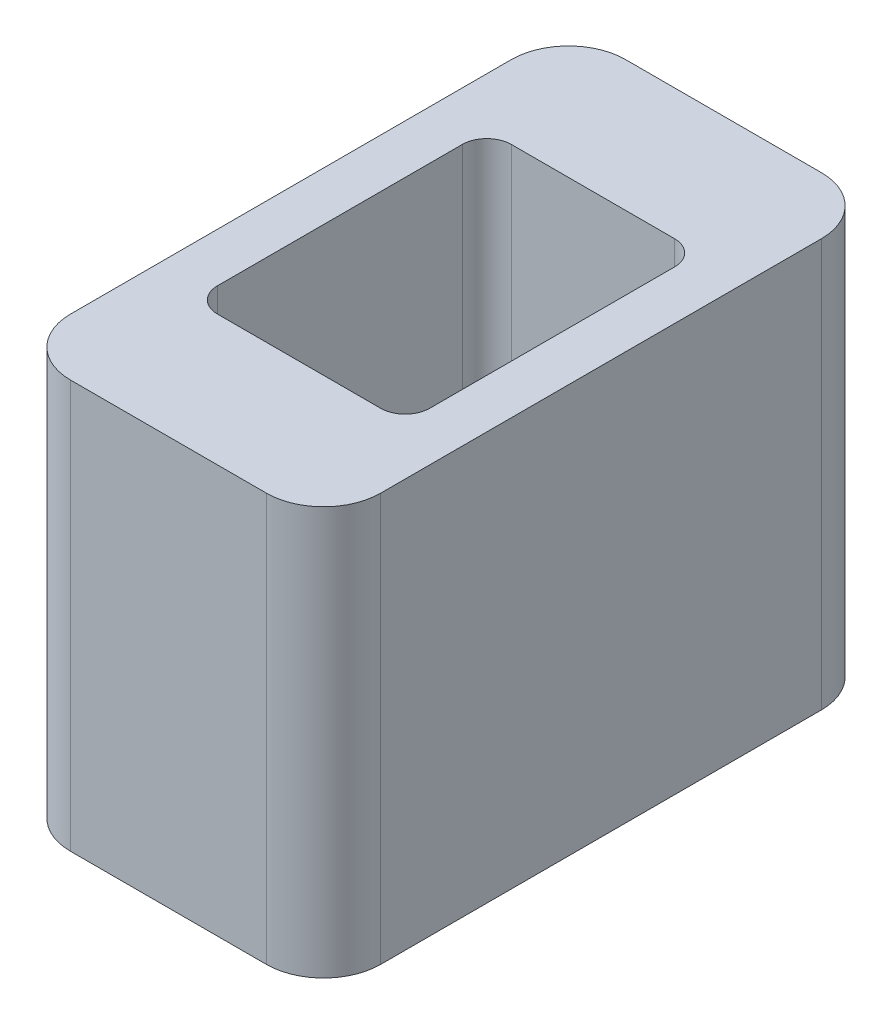
ISO-10303-21;
HEADER;
FILE_DESCRIPTION(('STEP AP214'),'2;1');
FILE_NAME('part.step','',(''),(''),'','','');
FILE_SCHEMA(('AUTOMOTIVE_DESIGN { 1 0 10303 214 1 1 1 1 }'));
ENDSEC;
DATA;
#1=APPLICATION_CONTEXT('core data for automotive mechanical design processes');
#2=APPLICATION_PROTOCOL_DEFINITION('international standard','automotive_design',2000,#1);
#3=PRODUCT_CONTEXT('',#1,'mechanical');
#4=PRODUCT('Part','Part','',(#3));
#5=PRODUCT_RELATED_PRODUCT_CATEGORY('part','',(#4));
#6=PRODUCT_DEFINITION_FORMATION('','',#4);
#7=PRODUCT_DEFINITION_CONTEXT('part definition',#1,'design');
#8=PRODUCT_DEFINITION('design','',#6,#7);
#9=PRODUCT_DEFINITION_SHAPE('','',#8);
#10=(LENGTH_UNIT() NAMED_UNIT(*) SI_UNIT(.MILLI.,.METRE.));
#11=(NAMED_UNIT(*) PLANE_ANGLE_UNIT() SI_UNIT($,.RADIAN.));
#12=(NAMED_UNIT(*) SI_UNIT($,.STERADIAN.) SOLID_ANGLE_UNIT());
#13=UNCERTAINTY_MEASURE_WITH_UNIT(LENGTH_MEASURE(1.E-05),#10,'distance_accuracy_value','');
#14=(GEOMETRIC_REPRESENTATION_CONTEXT(3) GLOBAL_UNCERTAINTY_ASSIGNED_CONTEXT((#13)) GLOBAL_UNIT_ASSIGNED_CONTEXT((#10,
#11,#12)) REPRESENTATION_CONTEXT('',''));
#15=CARTESIAN_POINT('',(0.,0.,0.));
#16=DIRECTION('',(0.,0.,1.));
#17=DIRECTION('',(1.,0.,0.));
#18=AXIS2_PLACEMENT_3D('',#15,#16,#17);
#19=CARTESIAN_POINT('',(-50.2610968965143,8.00000000000036,-55.2200768086937));
#20=DIRECTION('',(0.,-1.,0.));
#21=DIRECTION('',(-1.,0.,0.));
#22=AXIS2_PLACEMENT_3D('',#19,#20,#21);
#23=PLANE('',#22);
#24=DIRECTION('',(-1.,0.,0.));
#25=VECTOR('',#24,1.);
#26=CARTESIAN_POINT('',(8.65,8.,2.79999999999879));
#27=LINE('',#26,#25);
#28=CARTESIAN_POINT('',(8.65,8.,2.79999999999879));
#29=VERTEX_POINT('',#28);
#30=CARTESIAN_POINT('',(6.65000000000012,8.,2.79999999999879));
#31=VERTEX_POINT('',#30);
#32=EDGE_CURVE('E203',#29,#31,#27,.T.);
#33=ORIENTED_EDGE('',*,*,#32,.F.);
#34=CARTESIAN_POINT('',(8.65,8.,3.09999999999888));
#35=DIRECTION('',(0.,-1.,0.));
#36=DIRECTION('',(1.,0.,0.));
#37=AXIS2_PLACEMENT_3D('',#34,#35,#36);
#38=CIRCLE('',#37,0.300000000000047);
#39=CARTESIAN_POINT('',(8.95,7.9999999999999,3.09999999999888));
#40=VERTEX_POINT('',#39);
#41=EDGE_CURVE('E229',#29,#40,#38,.T.);
#42=ORIENTED_EDGE('',*,*,#41,.T.);
#43=DIRECTION('',(0.,0.,1.));
#44=VECTOR('',#43,1.);
#45=CARTESIAN_POINT('',(8.95,7.9999999999999,3.09999999999888));
#46=LINE('',#45,#44);
#47=CARTESIAN_POINT('',(8.95,7.9999999999999,6.09999999999889));
#48=VERTEX_POINT('',#47);
#49=EDGE_CURVE('E323',#40,#48,#46,.T.);
#50=ORIENTED_EDGE('',*,*,#49,.T.);
#51=CARTESIAN_POINT('',(8.65,8.,6.09999999999889));
#52=DIRECTION('',(0.,-1.,0.));
#53=DIRECTION('',(1.,0.,0.));
#54=AXIS2_PLACEMENT_3D('',#51,#52,#53);
#55=CIRCLE('',#54,0.29999999999994);
#56=CARTESIAN_POINT('',(8.65,8.,6.39999999999878));
#57=VERTEX_POINT('',#56);
#58=EDGE_CURVE('E246',#48,#57,#55,.T.);
#59=ORIENTED_EDGE('',*,*,#58,.T.);
#60=DIRECTION('',(1.,0.,0.));
#61=VECTOR('',#60,1.);
#62=CARTESIAN_POINT('',(6.65000000000012,8.,6.3999999999989));
#63=LINE('',#62,#61);
#64=CARTESIAN_POINT('',(6.65000000000012,8.,6.3999999999989));
#65=VERTEX_POINT('',#64);
#66=EDGE_CURVE('E63',#65,#57,#63,.T.);
#67=ORIENTED_EDGE('',*,*,#66,.F.);
#68=CARTESIAN_POINT('',(6.65000000000012,8.,6.09999999999889));
#69=DIRECTION('',(0.,-1.,0.));
#70=DIRECTION('',(1.,0.,0.));
#71=AXIS2_PLACEMENT_3D('',#68,#69,#70);
#72=CIRCLE('',#71,0.29999999999999);
#73=CARTESIAN_POINT('',(6.35000000000011,8.,6.09999999999889));
#74=VERTEX_POINT('',#73);
#75=EDGE_CURVE('E256',#65,#74,#72,.T.);
#76=ORIENTED_EDGE('',*,*,#75,.T.);
#77=DIRECTION('',(0.,0.,1.));
#78=VECTOR('',#77,1.);
#79=CARTESIAN_POINT('',(6.35000000000011,8.,3.09999999999888));
#80=LINE('',#79,#78);
#81=CARTESIAN_POINT('',(6.35000000000011,8.,3.09999999999888));
#82=VERTEX_POINT('',#81);
#83=EDGE_CURVE('E266',#82,#74,#80,.T.);
#84=ORIENTED_EDGE('',*,*,#83,.F.);
#85=CARTESIAN_POINT('',(6.65000000000012,8.,3.09999999999888));
#86=DIRECTION('',(0.,-1.,0.));
#87=DIRECTION('',(1.,0.,0.));
#88=AXIS2_PLACEMENT_3D('',#85,#86,#87);
#89=CIRCLE('',#88,0.300000000000011);
#90=EDGE_CURVE('E285',#82,#31,#89,.T.);
#91=ORIENTED_EDGE('',*,*,#90,.T.);
#92=EDGE_LOOP('',(#33,#42,#50,#59,#67,#76,#84,#91));
#93=FACE_BOUND('',#92,.T.);
#94=CARTESIAN_POINT('',(8.84999999999982,8.00000000000019,1.8999999999989));
#95=DIRECTION('',(0.,-1.,0.));
#96=DIRECTION('',(1.,0.,0.));
#97=AXIS2_PLACEMENT_3D('',#94,#95,#96);
#98=CIRCLE('',#97,0.7);
#99=CARTESIAN_POINT('',(8.84999999999982,8.00000000000019,1.19999999999879));
#100=VERTEX_POINT('',#99);
#101=CARTESIAN_POINT('',(9.55000000000015,7.99999999999989,1.8999999999989));
#102=VERTEX_POINT('',#101);
#103=EDGE_CURVE('E199',#100,#102,#98,.T.);
#104=ORIENTED_EDGE('',*,*,#103,.F.);
#105=DIRECTION('',(1.,0.,0.));
#106=VECTOR('',#105,1.);
#107=CARTESIAN_POINT('',(6.44999999999965,8.00000000000043,1.19999999999879));
#108=LINE('',#107,#106);
#109=CARTESIAN_POINT('',(6.44999999999965,8.00000000000043,1.19999999999879));
#110=VERTEX_POINT('',#109);
#111=EDGE_CURVE('E26',#110,#100,#108,.T.);
#112=ORIENTED_EDGE('',*,*,#111,.F.);
#113=CARTESIAN_POINT('',(6.44999999999965,8.00000000000043,1.8999999999989));
#114=DIRECTION('',(0.,-1.,0.));
#115=DIRECTION('',(1.,0.,0.));
#116=AXIS2_PLACEMENT_3D('',#113,#114,#115);
#117=CIRCLE('',#116,0.699999999999989);
#118=CARTESIAN_POINT('',(5.75,8.,1.8999999999989));
#119=VERTEX_POINT('',#118);
#120=EDGE_CURVE('E186',#119,#110,#117,.T.);
#121=ORIENTED_EDGE('',*,*,#120,.F.);
#122=DIRECTION('',(0.,0.,-1.));
#123=VECTOR('',#122,1.);
#124=CARTESIAN_POINT('',(5.75,8.,7.29999999999889));
#125=LINE('',#124,#123);
#126=CARTESIAN_POINT('',(5.75,8.,7.29999999999889));
#127=VERTEX_POINT('',#126);
#128=EDGE_CURVE('E190',#127,#119,#125,.T.);
#129=ORIENTED_EDGE('',*,*,#128,.F.);
#130=CARTESIAN_POINT('',(6.44999999999965,8.00000000000043,7.29999999999889));
#131=DIRECTION('',(0.,-1.,0.));
#132=DIRECTION('',(1.,0.,0.));
#133=AXIS2_PLACEMENT_3D('',#130,#131,#132);
#134=CIRCLE('',#133,0.699999999999989);
#135=CARTESIAN_POINT('',(6.44999999999965,8.00000000000043,7.99999999999889));
#136=VERTEX_POINT('',#135);
#137=EDGE_CURVE('E277',#136,#127,#134,.T.);
#138=ORIENTED_EDGE('',*,*,#137,.F.);
#139=DIRECTION('',(1.,0.,0.));
#140=VECTOR('',#139,1.);
#141=CARTESIAN_POINT('',(6.44999999999965,8.00000000000043,7.99999999999889));
#142=LINE('',#141,#140);
#143=CARTESIAN_POINT('',(8.84999999999982,8.00000000000019,7.99999999999889));
#144=VERTEX_POINT('',#143);
#145=EDGE_CURVE('E243',#136,#144,#142,.T.);
#146=ORIENTED_EDGE('',*,*,#145,.T.);
#147=CARTESIAN_POINT('',(8.84999999999982,8.00000000000019,7.29999999999889));
#148=DIRECTION('',(0.,-1.,0.));
#149=DIRECTION('',(1.,0.,0.));
#150=AXIS2_PLACEMENT_3D('',#147,#148,#149);
#151=CIRCLE('',#150,0.699999999999989);
#152=CARTESIAN_POINT('',(9.55000000000015,7.99999999999989,7.29999999999889));
#153=VERTEX_POINT('',#152);
#154=EDGE_CURVE('E134',#153,#144,#151,.T.);
#155=ORIENTED_EDGE('',*,*,#154,.F.);
#156=DIRECTION('',(0.,0.,-1.));
#157=VECTOR('',#156,1.);
#158=CARTESIAN_POINT('',(9.55000000000015,7.99999999999989,7.29999999999889));
#159=LINE('',#158,#157);
#160=EDGE_CURVE('E343',#153,#102,#159,.T.);
#161=ORIENTED_EDGE('',*,*,#160,.T.);
#162=EDGE_LOOP('',(#104,#112,#121,#129,#138,#146,#155,#161));
#163=FACE_BOUND('',#162,.T.);
#164=ADVANCED_FACE('F15',(#93,#163),#23,.F.);
#165=CARTESIAN_POINT('',(-50.2610968965141,3.00000000000021,-55.2200768086937));
#166=DIRECTION('',(0.,-1.,0.));
#167=DIRECTION('',(-1.,0.,0.));
#168=AXIS2_PLACEMENT_3D('',#165,#166,#167);
#169=PLANE('',#168);
#170=CARTESIAN_POINT('',(6.65000000000032,2.99999999999976,3.09999999999888));
#171=DIRECTION('',(0.,-1.,0.));
#172=DIRECTION('',(1.,0.,0.));
#173=AXIS2_PLACEMENT_3D('',#170,#171,#172);
#174=CIRCLE('',#173,0.300000000000011);
#175=CARTESIAN_POINT('',(6.35000000000025,2.99999999999977,3.09999999999888));
#176=VERTEX_POINT('',#175);
#177=CARTESIAN_POINT('',(6.65000000000032,2.99999999999976,2.79999999999879));
#178=VERTEX_POINT('',#177);
#179=EDGE_CURVE('E263',#176,#178,#174,.T.);
#180=ORIENTED_EDGE('',*,*,#179,.F.);
#181=DIRECTION('',(0.,0.,1.));
#182=VECTOR('',#181,1.);
#183=CARTESIAN_POINT('',(6.35000000000025,2.99999999999977,3.09999999999888));
#184=LINE('',#183,#182);
#185=CARTESIAN_POINT('',(6.35000000000025,2.99999999999977,6.09999999999889));
#186=VERTEX_POINT('',#185);
#187=EDGE_CURVE('E237',#176,#186,#184,.T.);
#188=ORIENTED_EDGE('',*,*,#187,.T.);
#189=CARTESIAN_POINT('',(6.65000000000032,2.99999999999976,6.09999999999889));
#190=DIRECTION('',(0.,-1.,0.));
#191=DIRECTION('',(1.,0.,0.));
#192=AXIS2_PLACEMENT_3D('',#189,#190,#191);
#193=CIRCLE('',#192,0.29999999999999);
#194=CARTESIAN_POINT('',(6.65000000000032,2.99999999999976,6.3999999999989));
#195=VERTEX_POINT('',#194);
#196=EDGE_CURVE('E79',#195,#186,#193,.T.);
#197=ORIENTED_EDGE('',*,*,#196,.F.);
#198=DIRECTION('',(1.,0.,0.));
#199=VECTOR('',#198,1.);
#200=CARTESIAN_POINT('',(6.65000000000032,2.99999999999976,6.3999999999989));
#201=LINE('',#200,#199);
#202=CARTESIAN_POINT('',(8.65000000000023,2.99999999999981,6.3999999999989));
#203=VERTEX_POINT('',#202);
#204=EDGE_CURVE('E259',#195,#203,#201,.T.);
#205=ORIENTED_EDGE('',*,*,#204,.T.);
#206=CARTESIAN_POINT('',(8.65000000000023,2.99999999999981,6.09999999999889));
#207=DIRECTION('',(0.,-1.,0.));
#208=DIRECTION('',(1.,0.,0.));
#209=AXIS2_PLACEMENT_3D('',#206,#207,#208);
#210=CIRCLE('',#209,0.29999999999994);
#211=CARTESIAN_POINT('',(8.95000000000022,2.99999999999975,6.09999999999889));
#212=VERTEX_POINT('',#211);
#213=EDGE_CURVE('E202',#212,#203,#210,.T.);
#214=ORIENTED_EDGE('',*,*,#213,.F.);
#215=DIRECTION('',(0.,0.,1.));
#216=VECTOR('',#215,1.);
#217=CARTESIAN_POINT('',(8.95000000000022,2.99999999999975,3.09999999999888));
#218=LINE('',#217,#216);
#219=CARTESIAN_POINT('',(8.95000000000022,2.99999999999975,3.09999999999888));
#220=VERTEX_POINT('',#219);
#221=EDGE_CURVE('E280',#220,#212,#218,.T.);
#222=ORIENTED_EDGE('',*,*,#221,.F.);
#223=CARTESIAN_POINT('',(8.65000000000023,2.99999999999981,3.09999999999888));
#224=DIRECTION('',(0.,-1.,0.));
#225=DIRECTION('',(1.,0.,0.));
#226=AXIS2_PLACEMENT_3D('',#223,#224,#225);
#227=CIRCLE('',#226,0.300000000000047);
#228=CARTESIAN_POINT('',(8.65000000000023,2.99999999999981,2.79999999999879));
#229=VERTEX_POINT('',#228);
#230=EDGE_CURVE('E207',#229,#220,#227,.T.);
#231=ORIENTED_EDGE('',*,*,#230,.F.);
#232=DIRECTION('',(-1.,0.,0.));
#233=VECTOR('',#232,1.);
#234=CARTESIAN_POINT('',(8.65000000000023,2.99999999999981,2.79999999999879));
#235=LINE('',#234,#233);
#236=EDGE_CURVE('E215',#229,#178,#235,.T.);
#237=ORIENTED_EDGE('',*,*,#236,.T.);
#238=EDGE_LOOP('',(#180,#188,#197,#205,#214,#222,#231,#237));
#239=FACE_BOUND('',#238,.T.);
#240=DIRECTION('',(0.,0.,-1.));
#241=VECTOR('',#240,1.);
#242=CARTESIAN_POINT('',(9.54999999999964,3.00000000000045,7.29999999999889));
#243=LINE('',#242,#241);
#244=CARTESIAN_POINT('',(9.54999999999964,3.00000000000045,7.29999999999889));
#245=VERTEX_POINT('',#244);
#246=CARTESIAN_POINT('',(9.54999999999964,3.00000000000045,1.8999999999989));
#247=VERTEX_POINT('',#246);
#248=EDGE_CURVE('E326',#245,#247,#243,.T.);
#249=ORIENTED_EDGE('',*,*,#248,.F.);
#250=CARTESIAN_POINT('',(8.85,3.,7.29999999999889));
#251=DIRECTION('',(0.,-1.,0.));
#252=DIRECTION('',(1.,0.,0.));
#253=AXIS2_PLACEMENT_3D('',#250,#251,#252);
#254=CIRCLE('',#253,0.699999999999989);
#255=CARTESIAN_POINT('',(8.85,3.,7.99999999999889));
#256=VERTEX_POINT('',#255);
#257=EDGE_CURVE('E145',#245,#256,#254,.T.);
#258=ORIENTED_EDGE('',*,*,#257,.T.);
#259=DIRECTION('',(1.,0.,0.));
#260=VECTOR('',#259,1.);
#261=CARTESIAN_POINT('',(6.44999999999985,3.00000000000025,7.99999999999889));
#262=LINE('',#261,#260);
#263=CARTESIAN_POINT('',(6.44999999999985,3.00000000000025,7.99999999999889));
#264=VERTEX_POINT('',#263);
#265=EDGE_CURVE('E242',#264,#256,#262,.T.);
#266=ORIENTED_EDGE('',*,*,#265,.F.);
#267=CARTESIAN_POINT('',(6.44999999999985,3.00000000000025,7.29999999999889));
#268=DIRECTION('',(0.,-1.,0.));
#269=DIRECTION('',(1.,0.,0.));
#270=AXIS2_PLACEMENT_3D('',#267,#268,#269);
#271=CIRCLE('',#270,0.699999999999989);
#272=CARTESIAN_POINT('',(5.75000000000023,2.99999999999985,7.29999999999889));
#273=VERTEX_POINT('',#272);
#274=EDGE_CURVE('E181',#264,#273,#271,.T.);
#275=ORIENTED_EDGE('',*,*,#274,.T.);
#276=DIRECTION('',(0.,0.,-1.));
#277=VECTOR('',#276,1.);
#278=CARTESIAN_POINT('',(5.75000000000023,2.99999999999985,7.29999999999889));
#279=LINE('',#278,#277);
#280=CARTESIAN_POINT('',(5.75000000000023,2.99999999999985,1.8999999999989));
#281=VERTEX_POINT('',#280);
#282=EDGE_CURVE('E178',#273,#281,#279,.T.);
#283=ORIENTED_EDGE('',*,*,#282,.T.);
#284=CARTESIAN_POINT('',(6.44999999999985,3.00000000000025,1.8999999999989));
#285=DIRECTION('',(0.,-1.,0.));
#286=DIRECTION('',(1.,0.,0.));
#287=AXIS2_PLACEMENT_3D('',#284,#285,#286);
#288=CIRCLE('',#287,0.699999999999989);
#289=CARTESIAN_POINT('',(6.44999999999985,3.00000000000025,1.19999999999879));
#290=VERTEX_POINT('',#289);
#291=EDGE_CURVE('E165',#281,#290,#288,.T.);
#292=ORIENTED_EDGE('',*,*,#291,.T.);
#293=DIRECTION('',(1.,0.,0.));
#294=VECTOR('',#293,1.);
#295=CARTESIAN_POINT('',(6.44999999999985,3.00000000000025,1.19999999999879));
#296=LINE('',#295,#294);
#297=CARTESIAN_POINT('',(8.85,3.,1.19999999999879));
#298=VERTEX_POINT('',#297);
#299=EDGE_CURVE('E10',#290,#298,#296,.T.);
#300=ORIENTED_EDGE('',*,*,#299,.T.);
#301=CARTESIAN_POINT('',(8.85,3.,1.8999999999989));
#302=DIRECTION('',(0.,-1.,0.));
#303=DIRECTION('',(1.,0.,0.));
#304=AXIS2_PLACEMENT_3D('',#301,#302,#303);
#305=CIRCLE('',#304,0.7);
#306=EDGE_CURVE('E250',#298,#247,#305,.T.);
#307=ORIENTED_EDGE('',*,*,#306,.T.);
#308=EDGE_LOOP('',(#249,#258,#266,#275,#283,#292,#300,#307));
#309=FACE_BOUND('',#308,.T.);
#310=ADVANCED_FACE('F179',(#239,#309),#169,.T.);
#311=CARTESIAN_POINT('',(8.84999999999982,8.00000000000019,1.19999999999879));
#312=DIRECTION('',(0.,0.,-1.));
#313=DIRECTION('',(0.707106781186542,-0.707106781186553,0.));
#314=AXIS2_PLACEMENT_3D('',#311,#312,#313);
#315=PLANE('',#314);
#316=ORIENTED_EDGE('',*,*,#111,.T.);
#317=DIRECTION('',(0.,-1.,0.));
#318=VECTOR('',#317,1.);
#319=CARTESIAN_POINT('',(8.84999999999982,8.00000000000019,1.19999999999879));
#320=LINE('',#319,#318);
#321=EDGE_CURVE('E271',#100,#298,#320,.T.);
#322=ORIENTED_EDGE('',*,*,#321,.T.);
#323=ORIENTED_EDGE('',*,*,#299,.F.);
#324=DIRECTION('',(0.,-1.,0.));
#325=VECTOR('',#324,1.);
#326=CARTESIAN_POINT('',(6.44999999999965,8.00000000000043,1.19999999999879));
#327=LINE('',#326,#325);
#328=EDGE_CURVE('E172',#110,#290,#327,.T.);
#329=ORIENTED_EDGE('',*,*,#328,.F.);
#330=EDGE_LOOP('',(#316,#322,#323,#329));
#331=FACE_BOUND('',#330,.T.);
#332=ADVANCED_FACE('F395',(#331),#315,.T.);
#333=CARTESIAN_POINT('',(6.44999999999965,8.00000000000043,1.8999999999989));
#334=DIRECTION('',(0.,-1.,0.));
#335=DIRECTION('',(1.,0.,0.));
#336=AXIS2_PLACEMENT_3D('',#333,#334,#335);
#337=CYLINDRICAL_SURFACE('',#336,0.699999999999989);
#338=ORIENTED_EDGE('',*,*,#120,.T.);
#339=ORIENTED_EDGE('',*,*,#328,.T.);
#340=ORIENTED_EDGE('',*,*,#291,.F.);
#341=DIRECTION('',(0.,-1.,0.));
#342=VECTOR('',#341,1.);
#343=CARTESIAN_POINT('',(5.75,8.,1.8999999999989));
#344=LINE('',#343,#342);
#345=EDGE_CURVE('E170',#119,#281,#344,.T.);
#346=ORIENTED_EDGE('',*,*,#345,.F.);
#347=EDGE_LOOP('',(#338,#339,#340,#346));
#348=FACE_BOUND('',#347,.T.);
#349=ADVANCED_FACE('F168',(#348),#337,.T.);
#350=CARTESIAN_POINT('',(5.75,8.,1.8999999999989));
#351=DIRECTION('',(-1.,0.,0.));
#352=DIRECTION('',(0.,0.,1.));
#353=AXIS2_PLACEMENT_3D('',#350,#351,#352);
#354=PLANE('',#353);
#355=ORIENTED_EDGE('',*,*,#128,.T.);
#356=ORIENTED_EDGE('',*,*,#345,.T.);
#357=ORIENTED_EDGE('',*,*,#282,.F.);
#358=DIRECTION('',(0.,-1.,0.));
#359=VECTOR('',#358,1.);
#360=CARTESIAN_POINT('',(5.75,8.,7.29999999999889));
#361=LINE('',#360,#359);
#362=EDGE_CURVE('E19',#127,#273,#361,.T.);
#363=ORIENTED_EDGE('',*,*,#362,.F.);
#364=EDGE_LOOP('',(#355,#356,#357,#363));
#365=FACE_BOUND('',#364,.T.);
#366=ADVANCED_FACE('F188',(#365),#354,.T.);
#367=CARTESIAN_POINT('',(6.44999999999965,8.00000000000043,7.29999999999889));
#368=DIRECTION('',(0.,-1.,0.));
#369=DIRECTION('',(1.,0.,0.));
#370=AXIS2_PLACEMENT_3D('',#367,#368,#369);
#371=CYLINDRICAL_SURFACE('',#370,0.699999999999989);
#372=ORIENTED_EDGE('',*,*,#137,.T.);
#373=ORIENTED_EDGE('',*,*,#362,.T.);
#374=ORIENTED_EDGE('',*,*,#274,.F.);
#375=DIRECTION('',(0.,-1.,0.));
#376=VECTOR('',#375,1.);
#377=CARTESIAN_POINT('',(6.44999999999965,8.00000000000043,7.99999999999889));
#378=LINE('',#377,#376);
#379=EDGE_CURVE('E238',#136,#264,#378,.T.);
#380=ORIENTED_EDGE('',*,*,#379,.F.);
#381=EDGE_LOOP('',(#372,#373,#374,#380));
#382=FACE_BOUND('',#381,.T.);
#383=ADVANCED_FACE('F402',(#382),#371,.T.);
#384=CARTESIAN_POINT('',(6.44999999999965,8.00000000000043,7.99999999999889));
#385=DIRECTION('',(0.,0.,1.));
#386=DIRECTION('',(0.707106781186553,0.707106781186542,0.));
#387=AXIS2_PLACEMENT_3D('',#384,#385,#386);
#388=PLANE('',#387);
#389=DIRECTION('',(0.,-1.,0.));
#390=VECTOR('',#389,1.);
#391=CARTESIAN_POINT('',(8.84999999999982,8.00000000000019,7.99999999999889));
#392=LINE('',#391,#390);
#393=EDGE_CURVE('E262',#144,#256,#392,.T.);
#394=ORIENTED_EDGE('',*,*,#393,.F.);
#395=ORIENTED_EDGE('',*,*,#145,.F.);
#396=ORIENTED_EDGE('',*,*,#379,.T.);
#397=ORIENTED_EDGE('',*,*,#265,.T.);
#398=EDGE_LOOP('',(#394,#395,#396,#397));
#399=FACE_BOUND('',#398,.T.);
#400=ADVANCED_FACE('F362',(#399),#388,.T.);
#401=CARTESIAN_POINT('',(8.84999999999982,8.00000000000019,7.29999999999889));
#402=DIRECTION('',(0.,-1.,0.));
#403=DIRECTION('',(1.,0.,0.));
#404=AXIS2_PLACEMENT_3D('',#401,#402,#403);
#405=CYLINDRICAL_SURFACE('',#404,0.699999999999989);
#406=ORIENTED_EDGE('',*,*,#154,.T.);
#407=ORIENTED_EDGE('',*,*,#393,.T.);
#408=ORIENTED_EDGE('',*,*,#257,.F.);
#409=DIRECTION('',(0.,-1.,0.));
#410=VECTOR('',#409,1.);
#411=CARTESIAN_POINT('',(9.55000000000015,7.99999999999989,7.29999999999889));
#412=LINE('',#411,#410);
#413=EDGE_CURVE('E233',#153,#245,#412,.T.);
#414=ORIENTED_EDGE('',*,*,#413,.F.);
#415=EDGE_LOOP('',(#406,#407,#408,#414));
#416=FACE_BOUND('',#415,.T.);
#417=ADVANCED_FACE('F363',(#416),#405,.T.);
#418=CARTESIAN_POINT('',(9.55000000000015,7.99999999999989,7.29999999999889));
#419=DIRECTION('',(1.,0.,0.));
#420=DIRECTION('',(0.,0.,-1.));
#421=AXIS2_PLACEMENT_3D('',#418,#419,#420);
#422=PLANE('',#421);
#423=ORIENTED_EDGE('',*,*,#160,.F.);
#424=ORIENTED_EDGE('',*,*,#413,.T.);
#425=ORIENTED_EDGE('',*,*,#248,.T.);
#426=DIRECTION('',(0.,-1.,0.));
#427=VECTOR('',#426,1.);
#428=CARTESIAN_POINT('',(9.55000000000015,7.99999999999989,1.8999999999989));
#429=LINE('',#428,#427);
#430=EDGE_CURVE('E201',#102,#247,#429,.T.);
#431=ORIENTED_EDGE('',*,*,#430,.F.);
#432=EDGE_LOOP('',(#423,#424,#425,#431));
#433=FACE_BOUND('',#432,.T.);
#434=ADVANCED_FACE('F368',(#433),#422,.T.);
#435=CARTESIAN_POINT('',(8.84999999999982,8.00000000000019,1.8999999999989));
#436=DIRECTION('',(0.,-1.,0.));
#437=DIRECTION('',(1.,0.,0.));
#438=AXIS2_PLACEMENT_3D('',#435,#436,#437);
#439=CYLINDRICAL_SURFACE('',#438,0.7);
#440=ORIENTED_EDGE('',*,*,#103,.T.);
#441=ORIENTED_EDGE('',*,*,#430,.T.);
#442=ORIENTED_EDGE('',*,*,#306,.F.);
#443=ORIENTED_EDGE('',*,*,#321,.F.);
#444=EDGE_LOOP('',(#440,#441,#442,#443));
#445=FACE_BOUND('',#444,.T.);
#446=ADVANCED_FACE('F397',(#445),#439,.T.);
#447=CARTESIAN_POINT('',(8.65,8.,6.09999999999889));
#448=DIRECTION('',(0.,-1.,0.));
#449=DIRECTION('',(1.,0.,0.));
#450=AXIS2_PLACEMENT_3D('',#447,#448,#449);
#451=CYLINDRICAL_SURFACE('',#450,0.29999999999994);
#452=DIRECTION('',(0.,-1.,0.));
#453=VECTOR('',#452,1.);
#454=CARTESIAN_POINT('',(8.65,8.,6.3999999999989));
#455=LINE('',#454,#453);
#456=EDGE_CURVE('E311',#57,#203,#455,.T.);
#457=ORIENTED_EDGE('',*,*,#456,.F.);
#458=ORIENTED_EDGE('',*,*,#58,.F.);
#459=DIRECTION('',(0.,-1.,0.));
#460=VECTOR('',#459,1.);
#461=CARTESIAN_POINT('',(8.95,7.9999999999999,6.09999999999889));
#462=LINE('',#461,#460);
#463=EDGE_CURVE('E253',#48,#212,#462,.T.);
#464=ORIENTED_EDGE('',*,*,#463,.T.);
#465=ORIENTED_EDGE('',*,*,#213,.T.);
#466=EDGE_LOOP('',(#457,#458,#464,#465));
#467=FACE_BOUND('',#466,.T.);
#468=ADVANCED_FACE('F298',(#467),#451,.F.);
#469=CARTESIAN_POINT('',(8.65,8.,6.3999999999989));
#470=DIRECTION('',(0.,0.,-1.));
#471=DIRECTION('',(0.707106781186542,-0.707106781186553,0.));
#472=AXIS2_PLACEMENT_3D('',#469,#470,#471);
#473=PLANE('',#472);
#474=ORIENTED_EDGE('',*,*,#456,.T.);
#475=ORIENTED_EDGE('',*,*,#204,.F.);
#476=DIRECTION('',(0.,-1.,0.));
#477=VECTOR('',#476,1.);
#478=CARTESIAN_POINT('',(6.65000000000012,8.,6.3999999999989));
#479=LINE('',#478,#477);
#480=EDGE_CURVE('E235',#65,#195,#479,.T.);
#481=ORIENTED_EDGE('',*,*,#480,.F.);
#482=ORIENTED_EDGE('',*,*,#66,.T.);
#483=EDGE_LOOP('',(#474,#475,#481,#482));
#484=FACE_BOUND('',#483,.T.);
#485=ADVANCED_FACE('F313',(#484),#473,.T.);
#486=CARTESIAN_POINT('',(6.65000000000012,8.,6.09999999999889));
#487=DIRECTION('',(0.,-1.,0.));
#488=DIRECTION('',(1.,0.,0.));
#489=AXIS2_PLACEMENT_3D('',#486,#487,#488);
#490=CYLINDRICAL_SURFACE('',#489,0.29999999999999);
#491=ORIENTED_EDGE('',*,*,#480,.T.);
#492=ORIENTED_EDGE('',*,*,#196,.T.);
#493=DIRECTION('',(0.,-1.,0.));
#494=VECTOR('',#493,1.);
#495=CARTESIAN_POINT('',(6.35000000000011,8.,6.09999999999889));
#496=LINE('',#495,#494);
#497=EDGE_CURVE('E337',#74,#186,#496,.T.);
#498=ORIENTED_EDGE('',*,*,#497,.F.);
#499=ORIENTED_EDGE('',*,*,#75,.F.);
#500=EDGE_LOOP('',(#491,#492,#498,#499));
#501=FACE_BOUND('',#500,.T.);
#502=ADVANCED_FACE('F442',(#501),#490,.F.);
#503=CARTESIAN_POINT('',(6.35000000000011,8.,6.09999999999889));
#504=DIRECTION('',(1.,0.,0.));
#505=DIRECTION('',(0.,0.,-1.));
#506=AXIS2_PLACEMENT_3D('',#503,#504,#505);
#507=PLANE('',#506);
#508=ORIENTED_EDGE('',*,*,#83,.T.);
#509=ORIENTED_EDGE('',*,*,#497,.T.);
#510=ORIENTED_EDGE('',*,*,#187,.F.);
#511=DIRECTION('',(0.,-1.,0.));
#512=VECTOR('',#511,1.);
#513=CARTESIAN_POINT('',(6.35000000000011,8.,3.09999999999888));
#514=LINE('',#513,#512);
#515=EDGE_CURVE('E267',#82,#176,#514,.T.);
#516=ORIENTED_EDGE('',*,*,#515,.F.);
#517=EDGE_LOOP('',(#508,#509,#510,#516));
#518=FACE_BOUND('',#517,.T.);
#519=ADVANCED_FACE('F447',(#518),#507,.T.);
#520=CARTESIAN_POINT('',(6.65000000000012,8.,3.09999999999888));
#521=DIRECTION('',(0.,-1.,0.));
#522=DIRECTION('',(1.,0.,0.));
#523=AXIS2_PLACEMENT_3D('',#520,#521,#522);
#524=CYLINDRICAL_SURFACE('',#523,0.300000000000011);
#525=ORIENTED_EDGE('',*,*,#90,.F.);
#526=ORIENTED_EDGE('',*,*,#515,.T.);
#527=ORIENTED_EDGE('',*,*,#179,.T.);
#528=DIRECTION('',(0.,-1.,0.));
#529=VECTOR('',#528,1.);
#530=CARTESIAN_POINT('',(6.65000000000012,8.,2.79999999999879));
#531=LINE('',#530,#529);
#532=EDGE_CURVE('E206',#31,#178,#531,.T.);
#533=ORIENTED_EDGE('',*,*,#532,.F.);
#534=EDGE_LOOP('',(#525,#526,#527,#533));
#535=FACE_BOUND('',#534,.T.);
#536=ADVANCED_FACE('F17',(#535),#524,.F.);
#537=CARTESIAN_POINT('',(6.65000000000012,8.,2.79999999999879));
#538=DIRECTION('',(0.,0.,1.));
#539=DIRECTION('',(0.707106781186553,0.707106781186542,0.));
#540=AXIS2_PLACEMENT_3D('',#537,#538,#539);
#541=PLANE('',#540);
#542=ORIENTED_EDGE('',*,*,#32,.T.);
#543=ORIENTED_EDGE('',*,*,#532,.T.);
#544=ORIENTED_EDGE('',*,*,#236,.F.);
#545=DIRECTION('',(0.,-1.,0.));
#546=VECTOR('',#545,1.);
#547=CARTESIAN_POINT('',(8.65,8.,2.79999999999879));
#548=LINE('',#547,#546);
#549=EDGE_CURVE('E218',#29,#229,#548,.T.);
#550=ORIENTED_EDGE('',*,*,#549,.F.);
#551=EDGE_LOOP('',(#542,#543,#544,#550));
#552=FACE_BOUND('',#551,.T.);
#553=ADVANCED_FACE('F387',(#552),#541,.T.);
#554=CARTESIAN_POINT('',(8.65,8.,3.09999999999888));
#555=DIRECTION('',(0.,-1.,0.));
#556=DIRECTION('',(1.,0.,0.));
#557=AXIS2_PLACEMENT_3D('',#554,#555,#556);
#558=CYLINDRICAL_SURFACE('',#557,0.300000000000047);
#559=ORIENTED_EDGE('',*,*,#41,.F.);
#560=ORIENTED_EDGE('',*,*,#549,.T.);
#561=ORIENTED_EDGE('',*,*,#230,.T.);
#562=DIRECTION('',(0.,-1.,0.));
#563=VECTOR('',#562,1.);
#564=CARTESIAN_POINT('',(8.95,7.9999999999999,3.09999999999888));
#565=LINE('',#564,#563);
#566=EDGE_CURVE('E284',#40,#220,#565,.T.);
#567=ORIENTED_EDGE('',*,*,#566,.F.);
#568=EDGE_LOOP('',(#559,#560,#561,#567));
#569=FACE_BOUND('',#568,.T.);
#570=ADVANCED_FACE('F388',(#569),#558,.F.);
#571=CARTESIAN_POINT('',(8.95,7.9999999999999,3.09999999999888));
#572=DIRECTION('',(-1.,0.,0.));
#573=DIRECTION('',(0.,0.,1.));
#574=AXIS2_PLACEMENT_3D('',#571,#572,#573);
#575=PLANE('',#574);
#576=ORIENTED_EDGE('',*,*,#49,.F.);
#577=ORIENTED_EDGE('',*,*,#566,.T.);
#578=ORIENTED_EDGE('',*,*,#221,.T.);
#579=ORIENTED_EDGE('',*,*,#463,.F.);
#580=EDGE_LOOP('',(#576,#577,#578,#579));
#581=FACE_BOUND('',#580,.T.);
#582=ADVANCED_FACE('F304',(#581),#575,.T.);
#583=CLOSED_SHELL('',(#164,#310,#332,#349,#366,#383,#400,#417,#434,#446,#468,#485,#502,#519,
#536,#553,#570,#582));
#584=MANIFOLD_SOLID_BREP('B1',#583);
#585=ADVANCED_BREP_SHAPE_REPRESENTATION('',(#18,#584),#14);
#586=SHAPE_DEFINITION_REPRESENTATION(#9,#585);
ENDSEC;
END-ISO-10303-21;
